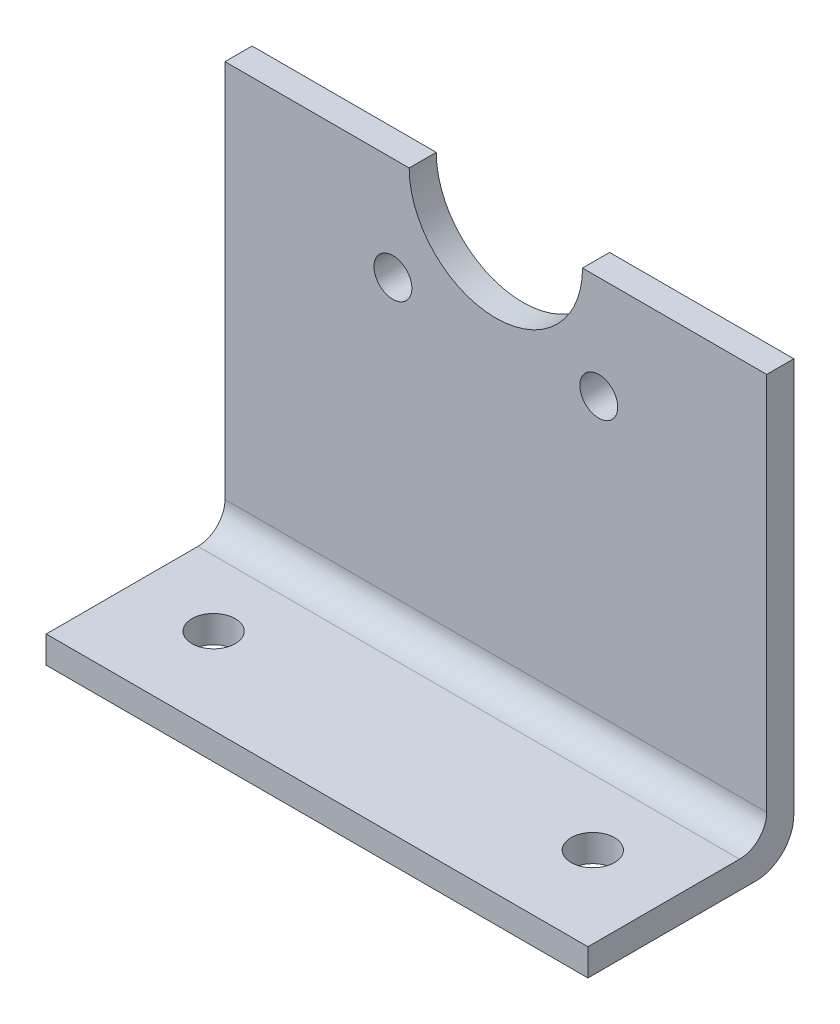
ISO-10303-21;
HEADER;
FILE_DESCRIPTION(('STEP AP214'),'2;1');
FILE_NAME('part.step','',(''),(''),'','','');
FILE_SCHEMA(('AUTOMOTIVE_DESIGN { 1 0 10303 214 1 1 1 1 }'));
ENDSEC;
DATA;
#1=APPLICATION_CONTEXT('core data for automotive mechanical design processes');
#2=APPLICATION_PROTOCOL_DEFINITION('international standard','automotive_design',2000,#1);
#3=PRODUCT_CONTEXT('',#1,'mechanical');
#4=PRODUCT('Part','Part','',(#3));
#5=PRODUCT_RELATED_PRODUCT_CATEGORY('part','',(#4));
#6=PRODUCT_DEFINITION_FORMATION('','',#4);
#7=PRODUCT_DEFINITION_CONTEXT('part definition',#1,'design');
#8=PRODUCT_DEFINITION('design','',#6,#7);
#9=PRODUCT_DEFINITION_SHAPE('','',#8);
#10=(LENGTH_UNIT() NAMED_UNIT(*) SI_UNIT(.MILLI.,.METRE.));
#11=(NAMED_UNIT(*) PLANE_ANGLE_UNIT() SI_UNIT($,.RADIAN.));
#12=(NAMED_UNIT(*) SI_UNIT($,.STERADIAN.) SOLID_ANGLE_UNIT());
#13=UNCERTAINTY_MEASURE_WITH_UNIT(LENGTH_MEASURE(1.E-05),#10,'distance_accuracy_value','');
#14=(GEOMETRIC_REPRESENTATION_CONTEXT(3) GLOBAL_UNCERTAINTY_ASSIGNED_CONTEXT((#13)) GLOBAL_UNIT_ASSIGNED_CONTEXT((#10,
#11,#12)) REPRESENTATION_CONTEXT('',''));
#15=CARTESIAN_POINT('',(0.,0.,0.));
#16=DIRECTION('',(0.,0.,1.));
#17=DIRECTION('',(1.,0.,0.));
#18=AXIS2_PLACEMENT_3D('',#15,#16,#17);
#19=CARTESIAN_POINT('',(50.,80.,5.));
#20=DIRECTION('',(0.,0.,1.));
#21=DIRECTION('',(1.,0.,0.));
#22=AXIS2_PLACEMENT_3D('',#19,#20,#21);
#23=PLANE('',#22);
#24=CARTESIAN_POINT('',(69.,61.,5.));
#25=DIRECTION('',(0.,0.,1.));
#26=DIRECTION('',(1.,0.,0.));
#27=AXIS2_PLACEMENT_3D('',#24,#25,#26);
#28=CIRCLE('',#27,3.50000000000001);
#29=CARTESIAN_POINT('',(72.5,61.,5.));
#30=VERTEX_POINT('',#29);
#31=EDGE_CURVE('E141',#30,#30,#28,.T.);
#32=ORIENTED_EDGE('',*,*,#31,.F.);
#33=EDGE_LOOP('',(#32));
#34=FACE_BOUND('',#33,.T.);
#35=CARTESIAN_POINT('',(31.,61.,5.));
#36=DIRECTION('',(0.,0.,1.));
#37=DIRECTION('',(1.,0.,0.));
#38=AXIS2_PLACEMENT_3D('',#35,#36,#37);
#39=CIRCLE('',#38,3.5);
#40=CARTESIAN_POINT('',(34.5,61.,5.));
#41=VERTEX_POINT('',#40);
#42=EDGE_CURVE('E147',#41,#41,#39,.T.);
#43=ORIENTED_EDGE('',*,*,#42,.F.);
#44=EDGE_LOOP('',(#43));
#45=FACE_BOUND('',#44,.T.);
#46=DIRECTION('',(0.,-1.,0.));
#47=VECTOR('',#46,1.);
#48=CARTESIAN_POINT('',(0.,0.,5.));
#49=LINE('',#48,#47);
#50=CARTESIAN_POINT('',(0.,80.,5.));
#51=VERTEX_POINT('',#50);
#52=CARTESIAN_POINT('',(0.,9.99999999999999,5.));
#53=VERTEX_POINT('',#52);
#54=EDGE_CURVE('E153',#51,#53,#49,.T.);
#55=ORIENTED_EDGE('',*,*,#54,.T.);
#56=DIRECTION('',(1.,0.,0.));
#57=VECTOR('',#56,1.);
#58=CARTESIAN_POINT('',(50.,9.99999999999999,5.));
#59=LINE('',#58,#57);
#60=CARTESIAN_POINT('',(100.,9.99999999999999,5.));
#61=VERTEX_POINT('',#60);
#62=EDGE_CURVE('E188',#53,#61,#59,.T.);
#63=ORIENTED_EDGE('',*,*,#62,.T.);
#64=DIRECTION('',(0.,1.,0.));
#65=VECTOR('',#64,1.);
#66=CARTESIAN_POINT('',(100.,0.,5.));
#67=LINE('',#66,#65);
#68=CARTESIAN_POINT('',(100.,80.,5.));
#69=VERTEX_POINT('',#68);
#70=EDGE_CURVE('E156',#61,#69,#67,.T.);
#71=ORIENTED_EDGE('',*,*,#70,.T.);
#72=DIRECTION('',(-1.,0.,0.));
#73=VECTOR('',#72,1.);
#74=CARTESIAN_POINT('',(66.,80.,5.));
#75=LINE('',#74,#73);
#76=CARTESIAN_POINT('',(66.,80.,5.));
#77=VERTEX_POINT('',#76);
#78=EDGE_CURVE('E159',#69,#77,#75,.T.);
#79=ORIENTED_EDGE('',*,*,#78,.T.);
#80=CARTESIAN_POINT('',(50.,80.,5.));
#81=DIRECTION('',(0.,0.,-1.));
#82=DIRECTION('',(1.,0.,0.));
#83=AXIS2_PLACEMENT_3D('',#80,#81,#82);
#84=CIRCLE('',#83,16.);
#85=CARTESIAN_POINT('',(34.,80.,5.));
#86=VERTEX_POINT('',#85);
#87=EDGE_CURVE('E161',#77,#86,#84,.T.);
#88=ORIENTED_EDGE('',*,*,#87,.T.);
#89=DIRECTION('',(-1.,0.,0.));
#90=VECTOR('',#89,1.);
#91=CARTESIAN_POINT('',(0.,80.,5.));
#92=LINE('',#91,#90);
#93=EDGE_CURVE('E163',#86,#51,#92,.T.);
#94=ORIENTED_EDGE('',*,*,#93,.T.);
#95=EDGE_LOOP('',(#55,#63,#71,#79,#88,#94));
#96=FACE_BOUND('',#95,.T.);
#97=ADVANCED_FACE('F31',(#34,#45,#96),#23,.T.);
#98=CARTESIAN_POINT('',(50.,80.,0.));
#99=DIRECTION('',(0.,0.,1.));
#100=DIRECTION('',(1.,0.,0.));
#101=AXIS2_PLACEMENT_3D('',#98,#99,#100);
#102=PLANE('',#101);
#103=DIRECTION('',(0.,1.,0.));
#104=VECTOR('',#103,1.);
#105=CARTESIAN_POINT('',(100.,0.,0.));
#106=LINE('',#105,#104);
#107=CARTESIAN_POINT('',(100.,7.,0.));
#108=VERTEX_POINT('',#107);
#109=CARTESIAN_POINT('',(100.,80.,0.));
#110=VERTEX_POINT('',#109);
#111=EDGE_CURVE('E167',#108,#110,#106,.T.);
#112=ORIENTED_EDGE('',*,*,#111,.F.);
#113=DIRECTION('',(1.,0.,0.));
#114=VECTOR('',#113,1.);
#115=CARTESIAN_POINT('',(50.,7.00000000000001,0.));
#116=LINE('',#115,#114);
#117=CARTESIAN_POINT('',(0.,7.,0.));
#118=VERTEX_POINT('',#117);
#119=EDGE_CURVE('E39',#108,#118,#116,.F.);
#120=ORIENTED_EDGE('',*,*,#119,.T.);
#121=DIRECTION('',(0.,-1.,0.));
#122=VECTOR('',#121,1.);
#123=CARTESIAN_POINT('',(0.,0.,0.));
#124=LINE('',#123,#122);
#125=CARTESIAN_POINT('',(0.,80.,0.));
#126=VERTEX_POINT('',#125);
#127=EDGE_CURVE('E150',#126,#118,#124,.T.);
#128=ORIENTED_EDGE('',*,*,#127,.F.);
#129=DIRECTION('',(-1.,0.,0.));
#130=VECTOR('',#129,1.);
#131=CARTESIAN_POINT('',(0.,80.,0.));
#132=LINE('',#131,#130);
#133=CARTESIAN_POINT('',(34.,80.,0.));
#134=VERTEX_POINT('',#133);
#135=EDGE_CURVE('E157',#134,#126,#132,.T.);
#136=ORIENTED_EDGE('',*,*,#135,.F.);
#137=CARTESIAN_POINT('',(50.,80.,0.));
#138=DIRECTION('',(0.,0.,-1.));
#139=DIRECTION('',(1.,0.,0.));
#140=AXIS2_PLACEMENT_3D('',#137,#138,#139);
#141=CIRCLE('',#140,16.);
#142=CARTESIAN_POINT('',(66.,80.,0.));
#143=VERTEX_POINT('',#142);
#144=EDGE_CURVE('E171',#143,#134,#141,.T.);
#145=ORIENTED_EDGE('',*,*,#144,.F.);
#146=DIRECTION('',(-1.,0.,0.));
#147=VECTOR('',#146,1.);
#148=CARTESIAN_POINT('',(66.,80.,0.));
#149=LINE('',#148,#147);
#150=EDGE_CURVE('E169',#110,#143,#149,.T.);
#151=ORIENTED_EDGE('',*,*,#150,.F.);
#152=EDGE_LOOP('',(#112,#120,#128,#136,#145,#151));
#153=FACE_BOUND('',#152,.T.);
#154=CARTESIAN_POINT('',(69.,61.,0.));
#155=DIRECTION('',(0.,0.,1.));
#156=DIRECTION('',(1.,0.,0.));
#157=AXIS2_PLACEMENT_3D('',#154,#155,#156);
#158=CIRCLE('',#157,3.50000000000001);
#159=CARTESIAN_POINT('',(72.5,61.,0.));
#160=VERTEX_POINT('',#159);
#161=EDGE_CURVE('E128',#160,#160,#158,.T.);
#162=ORIENTED_EDGE('',*,*,#161,.T.);
#163=EDGE_LOOP('',(#162));
#164=FACE_BOUND('',#163,.T.);
#165=CARTESIAN_POINT('',(31.,61.,0.));
#166=DIRECTION('',(0.,0.,1.));
#167=DIRECTION('',(1.,0.,0.));
#168=AXIS2_PLACEMENT_3D('',#165,#166,#167);
#169=CIRCLE('',#168,3.5);
#170=CARTESIAN_POINT('',(34.5,61.,0.));
#171=VERTEX_POINT('',#170);
#172=EDGE_CURVE('E144',#171,#171,#169,.T.);
#173=ORIENTED_EDGE('',*,*,#172,.T.);
#174=EDGE_LOOP('',(#173));
#175=FACE_BOUND('',#174,.T.);
#176=ADVANCED_FACE('F237',(#153,#164,#175),#102,.F.);
#177=CARTESIAN_POINT('',(0.,0.,5.));
#178=DIRECTION('',(1.,0.,0.));
#179=DIRECTION('',(0.,0.,-1.));
#180=AXIS2_PLACEMENT_3D('',#177,#178,#179);
#181=PLANE('',#180);
#182=ORIENTED_EDGE('',*,*,#127,.T.);
#183=CARTESIAN_POINT('',(0.,7.,7.));
#184=DIRECTION('',(1.,0.,0.));
#185=DIRECTION('',(0.,0.,-1.));
#186=AXIS2_PLACEMENT_3D('',#183,#184,#185);
#187=CIRCLE('',#186,7.);
#188=CARTESIAN_POINT('',(0.,0.,7.));
#189=VERTEX_POINT('',#188);
#190=EDGE_CURVE('E11',#118,#189,#187,.F.);
#191=ORIENTED_EDGE('',*,*,#190,.T.);
#192=DIRECTION('',(0.,0.,-1.));
#193=VECTOR('',#192,1.);
#194=CARTESIAN_POINT('',(0.,0.,5.));
#195=LINE('',#194,#193);
#196=CARTESIAN_POINT('',(0.,0.,38.));
#197=VERTEX_POINT('',#196);
#198=EDGE_CURVE('E124',#197,#189,#195,.T.);
#199=ORIENTED_EDGE('',*,*,#198,.F.);
#200=DIRECTION('',(0.,-1.,0.));
#201=VECTOR('',#200,1.);
#202=CARTESIAN_POINT('',(0.,5.,38.));
#203=LINE('',#202,#201);
#204=CARTESIAN_POINT('',(0.,5.,38.));
#205=VERTEX_POINT('',#204);
#206=EDGE_CURVE('E121',#205,#197,#203,.T.);
#207=ORIENTED_EDGE('',*,*,#206,.F.);
#208=DIRECTION('',(0.,0.,1.));
#209=VECTOR('',#208,1.);
#210=CARTESIAN_POINT('',(0.,5.,0.));
#211=LINE('',#210,#209);
#212=CARTESIAN_POINT('',(0.,5.,10.));
#213=VERTEX_POINT('',#212);
#214=EDGE_CURVE('E106',#213,#205,#211,.T.);
#215=ORIENTED_EDGE('',*,*,#214,.F.);
#216=CARTESIAN_POINT('',(0.,9.99999999999999,10.));
#217=DIRECTION('',(1.,0.,0.));
#218=DIRECTION('',(0.,0.,-1.));
#219=AXIS2_PLACEMENT_3D('',#216,#217,#218);
#220=CIRCLE('',#219,5.);
#221=EDGE_CURVE('E194',#213,#53,#220,.T.);
#222=ORIENTED_EDGE('',*,*,#221,.T.);
#223=ORIENTED_EDGE('',*,*,#54,.F.);
#224=DIRECTION('',(0.,0.,-1.));
#225=VECTOR('',#224,1.);
#226=CARTESIAN_POINT('',(0.,80.,5.));
#227=LINE('',#226,#225);
#228=EDGE_CURVE('E165',#51,#126,#227,.T.);
#229=ORIENTED_EDGE('',*,*,#228,.T.);
#230=EDGE_LOOP('',(#182,#191,#199,#207,#215,#222,#223,#229));
#231=FACE_BOUND('',#230,.T.);
#232=ADVANCED_FACE('F122',(#231),#181,.F.);
#233=CARTESIAN_POINT('',(0.,0.,5.));
#234=DIRECTION('',(0.,1.,0.));
#235=DIRECTION('',(0.,0.,1.));
#236=AXIS2_PLACEMENT_3D('',#233,#234,#235);
#237=PLANE('',#236);
#238=ORIENTED_EDGE('',*,*,#198,.T.);
#239=DIRECTION('',(1.,0.,0.));
#240=VECTOR('',#239,1.);
#241=CARTESIAN_POINT('',(0.,0.,7.));
#242=LINE('',#241,#240);
#243=CARTESIAN_POINT('',(100.,0.,7.));
#244=VERTEX_POINT('',#243);
#245=EDGE_CURVE('E196',#189,#244,#242,.T.);
#246=ORIENTED_EDGE('',*,*,#245,.T.);
#247=DIRECTION('',(0.,0.,-1.));
#248=VECTOR('',#247,1.);
#249=CARTESIAN_POINT('',(100.,0.,5.));
#250=LINE('',#249,#248);
#251=CARTESIAN_POINT('',(100.,0.,38.));
#252=VERTEX_POINT('',#251);
#253=EDGE_CURVE('E185',#252,#244,#250,.T.);
#254=ORIENTED_EDGE('',*,*,#253,.F.);
#255=DIRECTION('',(1.,0.,0.));
#256=VECTOR('',#255,1.);
#257=CARTESIAN_POINT('',(100.,0.,38.));
#258=LINE('',#257,#256);
#259=EDGE_CURVE('E138',#197,#252,#258,.T.);
#260=ORIENTED_EDGE('',*,*,#259,.F.);
#261=EDGE_LOOP('',(#238,#246,#254,#260));
#262=FACE_BOUND('',#261,.T.);
#263=CARTESIAN_POINT('',(15.,0.,22.1));
#264=DIRECTION('',(0.,1.,0.));
#265=DIRECTION('',(0.,0.,1.));
#266=AXIS2_PLACEMENT_3D('',#263,#264,#265);
#267=CIRCLE('',#266,4.);
#268=CARTESIAN_POINT('',(15.,0.,26.1));
#269=VERTEX_POINT('',#268);
#270=EDGE_CURVE('E208',#269,#269,#267,.T.);
#271=ORIENTED_EDGE('',*,*,#270,.T.);
#272=EDGE_LOOP('',(#271));
#273=FACE_BOUND('',#272,.T.);
#274=CARTESIAN_POINT('',(85.,0.,22.1));
#275=DIRECTION('',(0.,1.,0.));
#276=DIRECTION('',(0.,0.,1.));
#277=AXIS2_PLACEMENT_3D('',#274,#275,#276);
#278=CIRCLE('',#277,4.00000000000001);
#279=CARTESIAN_POINT('',(85.,0.,26.1));
#280=VERTEX_POINT('',#279);
#281=EDGE_CURVE('E214',#280,#280,#278,.T.);
#282=ORIENTED_EDGE('',*,*,#281,.T.);
#283=EDGE_LOOP('',(#282));
#284=FACE_BOUND('',#283,.T.);
#285=ADVANCED_FACE('F201',(#262,#273,#284),#237,.F.);
#286=CARTESIAN_POINT('',(100.,0.,5.));
#287=DIRECTION('',(-1.,0.,0.));
#288=DIRECTION('',(0.,-1.,0.));
#289=AXIS2_PLACEMENT_3D('',#286,#287,#288);
#290=PLANE('',#289);
#291=ORIENTED_EDGE('',*,*,#253,.T.);
#292=CARTESIAN_POINT('',(100.,7.,7.));
#293=DIRECTION('',(-1.,0.,0.));
#294=DIRECTION('',(0.,-1.,0.));
#295=AXIS2_PLACEMENT_3D('',#292,#293,#294);
#296=CIRCLE('',#295,7.);
#297=EDGE_CURVE('E53',#244,#108,#296,.F.);
#298=ORIENTED_EDGE('',*,*,#297,.T.);
#299=ORIENTED_EDGE('',*,*,#111,.T.);
#300=DIRECTION('',(0.,0.,-1.));
#301=VECTOR('',#300,1.);
#302=CARTESIAN_POINT('',(100.,80.,5.));
#303=LINE('',#302,#301);
#304=EDGE_CURVE('E182',#69,#110,#303,.T.);
#305=ORIENTED_EDGE('',*,*,#304,.F.);
#306=ORIENTED_EDGE('',*,*,#70,.F.);
#307=CARTESIAN_POINT('',(100.,9.99999999999999,10.));
#308=DIRECTION('',(-1.,0.,0.));
#309=DIRECTION('',(0.,-1.,0.));
#310=AXIS2_PLACEMENT_3D('',#307,#308,#309);
#311=CIRCLE('',#310,5.);
#312=CARTESIAN_POINT('',(100.,5.,10.));
#313=VERTEX_POINT('',#312);
#314=EDGE_CURVE('E192',#61,#313,#311,.T.);
#315=ORIENTED_EDGE('',*,*,#314,.T.);
#316=DIRECTION('',(0.,0.,-1.));
#317=VECTOR('',#316,1.);
#318=CARTESIAN_POINT('',(100.,5.,0.));
#319=LINE('',#318,#317);
#320=CARTESIAN_POINT('',(100.,5.,38.));
#321=VERTEX_POINT('',#320);
#322=EDGE_CURVE('E118',#321,#313,#319,.T.);
#323=ORIENTED_EDGE('',*,*,#322,.F.);
#324=DIRECTION('',(0.,-1.,0.));
#325=VECTOR('',#324,1.);
#326=CARTESIAN_POINT('',(100.,5.,38.));
#327=LINE('',#326,#325);
#328=EDGE_CURVE('E129',#321,#252,#327,.T.);
#329=ORIENTED_EDGE('',*,*,#328,.T.);
#330=EDGE_LOOP('',(#291,#298,#299,#305,#306,#315,#323,#329));
#331=FACE_BOUND('',#330,.T.);
#332=ADVANCED_FACE('F205',(#331),#290,.F.);
#333=CARTESIAN_POINT('',(66.,80.,5.));
#334=DIRECTION('',(0.,-1.,0.));
#335=DIRECTION('',(0.,0.,-1.));
#336=AXIS2_PLACEMENT_3D('',#333,#334,#335);
#337=PLANE('',#336);
#338=ORIENTED_EDGE('',*,*,#150,.T.);
#339=DIRECTION('',(0.,0.,-1.));
#340=VECTOR('',#339,1.);
#341=CARTESIAN_POINT('',(66.,80.,5.));
#342=LINE('',#341,#340);
#343=EDGE_CURVE('E179',#77,#143,#342,.T.);
#344=ORIENTED_EDGE('',*,*,#343,.F.);
#345=ORIENTED_EDGE('',*,*,#78,.F.);
#346=ORIENTED_EDGE('',*,*,#304,.T.);
#347=EDGE_LOOP('',(#338,#344,#345,#346));
#348=FACE_BOUND('',#347,.T.);
#349=ADVANCED_FACE('F255',(#348),#337,.F.);
#350=CARTESIAN_POINT('',(50.,80.,5.));
#351=DIRECTION('',(0.,0.,-1.));
#352=DIRECTION('',(-1.,0.,0.));
#353=AXIS2_PLACEMENT_3D('',#350,#351,#352);
#354=CYLINDRICAL_SURFACE('',#353,16.);
#355=ORIENTED_EDGE('',*,*,#144,.T.);
#356=DIRECTION('',(0.,0.,-1.));
#357=VECTOR('',#356,1.);
#358=CARTESIAN_POINT('',(34.,80.,5.));
#359=LINE('',#358,#357);
#360=EDGE_CURVE('E176',#86,#134,#359,.T.);
#361=ORIENTED_EDGE('',*,*,#360,.F.);
#362=ORIENTED_EDGE('',*,*,#87,.F.);
#363=ORIENTED_EDGE('',*,*,#343,.T.);
#364=EDGE_LOOP('',(#355,#361,#362,#363));
#365=FACE_BOUND('',#364,.T.);
#366=ADVANCED_FACE('F251',(#365),#354,.F.);
#367=CARTESIAN_POINT('',(0.,80.,5.));
#368=DIRECTION('',(0.,-1.,0.));
#369=DIRECTION('',(1.,0.,0.));
#370=AXIS2_PLACEMENT_3D('',#367,#368,#369);
#371=PLANE('',#370);
#372=ORIENTED_EDGE('',*,*,#135,.T.);
#373=ORIENTED_EDGE('',*,*,#228,.F.);
#374=ORIENTED_EDGE('',*,*,#93,.F.);
#375=ORIENTED_EDGE('',*,*,#360,.T.);
#376=EDGE_LOOP('',(#372,#373,#374,#375));
#377=FACE_BOUND('',#376,.T.);
#378=ADVANCED_FACE('F248',(#377),#371,.F.);
#379=CARTESIAN_POINT('',(31.,61.,5.));
#380=DIRECTION('',(0.,0.,-1.));
#381=DIRECTION('',(-1.,0.,0.));
#382=AXIS2_PLACEMENT_3D('',#379,#380,#381);
#383=CYLINDRICAL_SURFACE('',#382,3.5);
#384=ORIENTED_EDGE('',*,*,#42,.T.);
#385=EDGE_LOOP('',(#384));
#386=FACE_BOUND('',#385,.T.);
#387=ORIENTED_EDGE('',*,*,#172,.F.);
#388=EDGE_LOOP('',(#387));
#389=FACE_BOUND('',#388,.T.);
#390=ADVANCED_FACE('F232',(#386,#389),#383,.F.);
#391=CARTESIAN_POINT('',(69.,61.,5.));
#392=DIRECTION('',(0.,0.,-1.));
#393=DIRECTION('',(-1.,0.,0.));
#394=AXIS2_PLACEMENT_3D('',#391,#392,#393);
#395=CYLINDRICAL_SURFACE('',#394,3.50000000000001);
#396=ORIENTED_EDGE('',*,*,#31,.T.);
#397=EDGE_LOOP('',(#396));
#398=FACE_BOUND('',#397,.T.);
#399=ORIENTED_EDGE('',*,*,#161,.F.);
#400=EDGE_LOOP('',(#399));
#401=FACE_BOUND('',#400,.T.);
#402=ADVANCED_FACE('F224',(#398,#401),#395,.F.);
#403=CARTESIAN_POINT('',(100.,5.,38.));
#404=DIRECTION('',(0.,-1.,0.));
#405=DIRECTION('',(0.,0.,-1.));
#406=AXIS2_PLACEMENT_3D('',#403,#404,#405);
#407=PLANE('',#406);
#408=ORIENTED_EDGE('',*,*,#322,.T.);
#409=DIRECTION('',(1.,0.,0.));
#410=VECTOR('',#409,1.);
#411=CARTESIAN_POINT('',(100.,5.,10.));
#412=LINE('',#411,#410);
#413=EDGE_CURVE('E115',#313,#213,#412,.F.);
#414=ORIENTED_EDGE('',*,*,#413,.T.);
#415=ORIENTED_EDGE('',*,*,#214,.T.);
#416=DIRECTION('',(1.,0.,0.));
#417=VECTOR('',#416,1.);
#418=CARTESIAN_POINT('',(100.,5.,38.));
#419=LINE('',#418,#417);
#420=EDGE_CURVE('E112',#205,#321,#419,.T.);
#421=ORIENTED_EDGE('',*,*,#420,.T.);
#422=EDGE_LOOP('',(#408,#414,#415,#421));
#423=FACE_BOUND('',#422,.T.);
#424=CARTESIAN_POINT('',(15.,5.,22.1));
#425=DIRECTION('',(0.,1.,0.));
#426=DIRECTION('',(0.,0.,1.));
#427=AXIS2_PLACEMENT_3D('',#424,#425,#426);
#428=CIRCLE('',#427,4.);
#429=CARTESIAN_POINT('',(15.,5.,26.1));
#430=VERTEX_POINT('',#429);
#431=EDGE_CURVE('E139',#430,#430,#428,.T.);
#432=ORIENTED_EDGE('',*,*,#431,.F.);
#433=EDGE_LOOP('',(#432));
#434=FACE_BOUND('',#433,.T.);
#435=CARTESIAN_POINT('',(85.,5.,22.1));
#436=DIRECTION('',(0.,1.,0.));
#437=DIRECTION('',(0.,0.,1.));
#438=AXIS2_PLACEMENT_3D('',#435,#436,#437);
#439=CIRCLE('',#438,4.00000000000001);
#440=CARTESIAN_POINT('',(85.,5.,26.1));
#441=VERTEX_POINT('',#440);
#442=EDGE_CURVE('E211',#441,#441,#439,.T.);
#443=ORIENTED_EDGE('',*,*,#442,.F.);
#444=EDGE_LOOP('',(#443));
#445=FACE_BOUND('',#444,.T.);
#446=ADVANCED_FACE('F109',(#423,#434,#445),#407,.F.);
#447=CARTESIAN_POINT('',(100.,5.,38.));
#448=DIRECTION('',(0.,0.,-1.));
#449=DIRECTION('',(-1.,0.,0.));
#450=AXIS2_PLACEMENT_3D('',#447,#448,#449);
#451=PLANE('',#450);
#452=ORIENTED_EDGE('',*,*,#259,.T.);
#453=ORIENTED_EDGE('',*,*,#328,.F.);
#454=ORIENTED_EDGE('',*,*,#420,.F.);
#455=ORIENTED_EDGE('',*,*,#206,.T.);
#456=EDGE_LOOP('',(#452,#453,#454,#455));
#457=FACE_BOUND('',#456,.T.);
#458=ADVANCED_FACE('F131',(#457),#451,.F.);
#459=CARTESIAN_POINT('',(15.,5.,22.1));
#460=DIRECTION('',(0.,-1.,0.));
#461=DIRECTION('',(0.,0.,-1.));
#462=AXIS2_PLACEMENT_3D('',#459,#460,#461);
#463=CYLINDRICAL_SURFACE('',#462,4.);
#464=ORIENTED_EDGE('',*,*,#431,.T.);
#465=EDGE_LOOP('',(#464));
#466=FACE_BOUND('',#465,.T.);
#467=ORIENTED_EDGE('',*,*,#270,.F.);
#468=EDGE_LOOP('',(#467));
#469=FACE_BOUND('',#468,.T.);
#470=ADVANCED_FACE('F230',(#466,#469),#463,.F.);
#471=CARTESIAN_POINT('',(85.,5.,22.1));
#472=DIRECTION('',(0.,-1.,0.));
#473=DIRECTION('',(0.,0.,-1.));
#474=AXIS2_PLACEMENT_3D('',#471,#472,#473);
#475=CYLINDRICAL_SURFACE('',#474,4.00000000000001);
#476=ORIENTED_EDGE('',*,*,#442,.T.);
#477=EDGE_LOOP('',(#476));
#478=FACE_BOUND('',#477,.T.);
#479=ORIENTED_EDGE('',*,*,#281,.F.);
#480=EDGE_LOOP('',(#479));
#481=FACE_BOUND('',#480,.T.);
#482=ADVANCED_FACE('F220',(#478,#481),#475,.F.);
#483=CARTESIAN_POINT('',(50.,9.99999999999999,10.));
#484=DIRECTION('',(1.,0.,0.));
#485=DIRECTION('',(0.,0.,-1.));
#486=AXIS2_PLACEMENT_3D('',#483,#484,#485);
#487=CYLINDRICAL_SURFACE('',#486,5.);
#488=ORIENTED_EDGE('',*,*,#221,.F.);
#489=ORIENTED_EDGE('',*,*,#413,.F.);
#490=ORIENTED_EDGE('',*,*,#314,.F.);
#491=ORIENTED_EDGE('',*,*,#62,.F.);
#492=EDGE_LOOP('',(#488,#489,#490,#491));
#493=FACE_BOUND('',#492,.T.);
#494=ADVANCED_FACE('F265',(#493),#487,.F.);
#495=CARTESIAN_POINT('',(0.,7.,7.));
#496=DIRECTION('',(1.,0.,0.));
#497=DIRECTION('',(0.,0.,-1.));
#498=AXIS2_PLACEMENT_3D('',#495,#496,#497);
#499=CYLINDRICAL_SURFACE('',#498,7.);
#500=ORIENTED_EDGE('',*,*,#190,.F.);
#501=ORIENTED_EDGE('',*,*,#119,.F.);
#502=ORIENTED_EDGE('',*,*,#297,.F.);
#503=ORIENTED_EDGE('',*,*,#245,.F.);
#504=EDGE_LOOP('',(#500,#501,#502,#503));
#505=FACE_BOUND('',#504,.T.);
#506=ADVANCED_FACE('F33',(#505),#499,.T.);
#507=CLOSED_SHELL('',(#97,#176,#232,#285,#332,#349,#366,#378,#390,#402,#446,#458,#470,#482,#494,#506));
#508=MANIFOLD_SOLID_BREP('B2',#507);
#509=ADVANCED_BREP_SHAPE_REPRESENTATION('',(#18,#508),#14);
#510=SHAPE_DEFINITION_REPRESENTATION(#9,#509);
ENDSEC;
END-ISO-10303-21;
